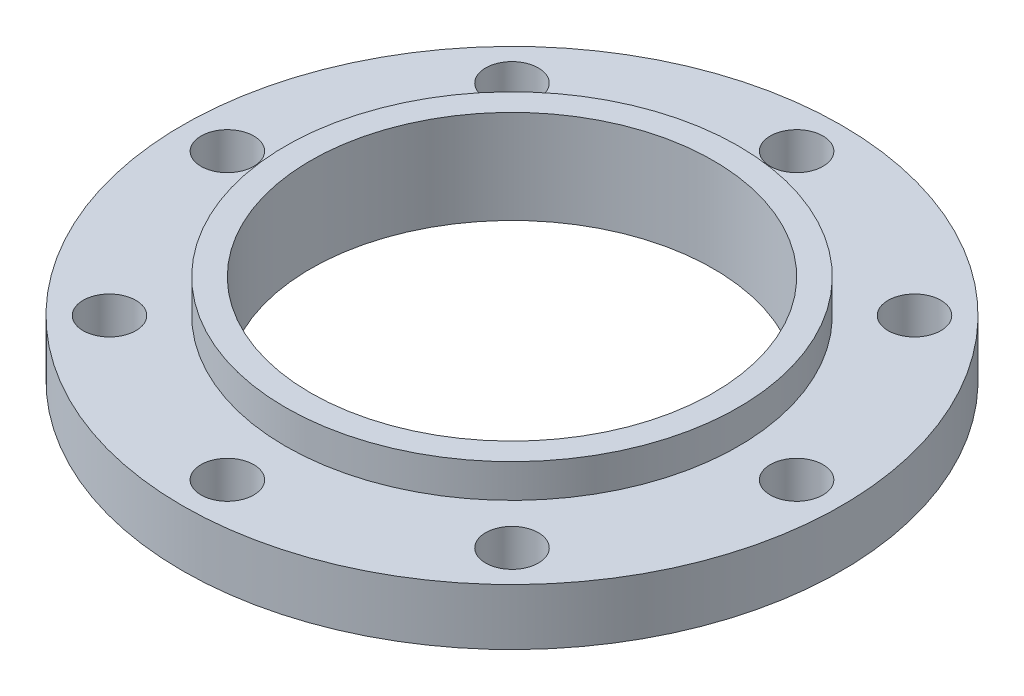
ISO-10303-21;
HEADER;
FILE_DESCRIPTION(('STEP AP214'),'2;1');
FILE_NAME('part.step','',(''),(''),'','','');
FILE_SCHEMA(('AUTOMOTIVE_DESIGN { 1 0 10303 214 1 1 1 1 }'));
ENDSEC;
DATA;
#1=APPLICATION_CONTEXT('core data for automotive mechanical design processes');
#2=APPLICATION_PROTOCOL_DEFINITION('international standard','automotive_design',2000,#1);
#3=PRODUCT_CONTEXT('',#1,'mechanical');
#4=PRODUCT('Part','Part','',(#3));
#5=PRODUCT_RELATED_PRODUCT_CATEGORY('part','',(#4));
#6=PRODUCT_DEFINITION_FORMATION('','',#4);
#7=PRODUCT_DEFINITION_CONTEXT('part definition',#1,'design');
#8=PRODUCT_DEFINITION('design','',#6,#7);
#9=PRODUCT_DEFINITION_SHAPE('','',#8);
#10=(LENGTH_UNIT() NAMED_UNIT(*) SI_UNIT(.MILLI.,.METRE.));
#11=(NAMED_UNIT(*) PLANE_ANGLE_UNIT() SI_UNIT($,.RADIAN.));
#12=(NAMED_UNIT(*) SI_UNIT($,.STERADIAN.) SOLID_ANGLE_UNIT());
#13=UNCERTAINTY_MEASURE_WITH_UNIT(LENGTH_MEASURE(1.E-05),#10,'distance_accuracy_value','');
#14=(GEOMETRIC_REPRESENTATION_CONTEXT(3) GLOBAL_UNCERTAINTY_ASSIGNED_CONTEXT((#13)) GLOBAL_UNIT_ASSIGNED_CONTEXT((#10,
#11,#12)) REPRESENTATION_CONTEXT('',''));
#15=CARTESIAN_POINT('',(0.,0.,0.));
#16=DIRECTION('',(0.,0.,1.));
#17=DIRECTION('',(1.,0.,0.));
#18=AXIS2_PLACEMENT_3D('',#15,#16,#17);
#19=CARTESIAN_POINT('',(0.,11.0243998816066,0.));
#20=DIRECTION('',(0.,-1.,0.));
#21=DIRECTION('',(0.,0.,-1.));
#22=AXIS2_PLACEMENT_3D('',#19,#20,#21);
#23=CYLINDRICAL_SURFACE('',#22,139.7);
#24=CARTESIAN_POINT('',(0.,11.0243998816066,0.));
#25=DIRECTION('',(0.,1.,0.));
#26=DIRECTION('',(0.,0.,1.));
#27=AXIS2_PLACEMENT_3D('',#24,#25,#26);
#28=CIRCLE('',#27,139.7);
#29=CARTESIAN_POINT('',(0.,11.0243998816066,139.7));
#30=VERTEX_POINT('',#29);
#31=EDGE_CURVE('E10',#30,#30,#28,.T.);
#32=ORIENTED_EDGE('',*,*,#31,.F.);
#33=EDGE_LOOP('',(#32));
#34=FACE_BOUND('',#33,.T.);
#35=CARTESIAN_POINT('',(0.,-12.8516001183934,0.));
#36=DIRECTION('',(0.,1.,0.));
#37=DIRECTION('',(0.,0.,1.));
#38=AXIS2_PLACEMENT_3D('',#35,#36,#37);
#39=CIRCLE('',#38,139.7);
#40=CARTESIAN_POINT('',(0.,-12.8516001183934,139.7));
#41=VERTEX_POINT('',#40);
#42=EDGE_CURVE('E42',#41,#41,#39,.T.);
#43=ORIENTED_EDGE('',*,*,#42,.T.);
#44=EDGE_LOOP('',(#43));
#45=FACE_BOUND('',#44,.T.);
#46=ADVANCED_FACE('F35',(#34,#45),#23,.T.);
#47=CARTESIAN_POINT('',(0.,11.0243998816066,0.));
#48=DIRECTION('',(0.,1.,0.));
#49=DIRECTION('',(0.,0.,1.));
#50=AXIS2_PLACEMENT_3D('',#47,#48,#49);
#51=PLANE('',#50);
#52=CARTESIAN_POINT('',(120.65,11.0243998816066,4.13197675184511E-13));
#53=DIRECTION('',(0.,1.,0.));
#54=DIRECTION('',(0.,0.,1.));
#55=AXIS2_PLACEMENT_3D('',#52,#53,#54);
#56=CIRCLE('',#55,11.176);
#57=CARTESIAN_POINT('',(120.65,11.0243998816066,11.1760000000004));
#58=VERTEX_POINT('',#57);
#59=EDGE_CURVE('E69',#58,#58,#56,.F.);
#60=ORIENTED_EDGE('',*,*,#59,.T.);
#61=EDGE_LOOP('',(#60));
#62=FACE_BOUND('',#61,.T.);
#63=CARTESIAN_POINT('',(85.3124331501565,11.0243998816066,85.3124331501574));
#64=DIRECTION('',(0.,1.,0.));
#65=DIRECTION('',(0.,0.,1.));
#66=AXIS2_PLACEMENT_3D('',#63,#64,#65);
#67=CIRCLE('',#66,11.176);
#68=CARTESIAN_POINT('',(85.3124331501565,11.0243998816066,96.4884331501574));
#69=VERTEX_POINT('',#68);
#70=EDGE_CURVE('E72',#69,#69,#67,.F.);
#71=ORIENTED_EDGE('',*,*,#70,.T.);
#72=EDGE_LOOP('',(#71));
#73=FACE_BOUND('',#72,.T.);
#74=CARTESIAN_POINT('',(0.,11.0243998816066,120.65));
#75=DIRECTION('',(0.,1.,0.));
#76=DIRECTION('',(0.,0.,1.));
#77=AXIS2_PLACEMENT_3D('',#74,#75,#76);
#78=CIRCLE('',#77,11.176);
#79=CARTESIAN_POINT('',(0.,11.0243998816066,131.826));
#80=VERTEX_POINT('',#79);
#81=EDGE_CURVE('E75',#80,#80,#78,.F.);
#82=ORIENTED_EDGE('',*,*,#81,.T.);
#83=EDGE_LOOP('',(#82));
#84=FACE_BOUND('',#83,.T.);
#85=CARTESIAN_POINT('',(-85.3124331501577,11.0243998816066,85.3124331501562));
#86=DIRECTION('',(0.,1.,0.));
#87=DIRECTION('',(0.,0.,1.));
#88=AXIS2_PLACEMENT_3D('',#85,#86,#87);
#89=CIRCLE('',#88,11.176);
#90=CARTESIAN_POINT('',(-85.3124331501577,11.0243998816066,96.4884331501562));
#91=VERTEX_POINT('',#90);
#92=EDGE_CURVE('E78',#91,#91,#89,.F.);
#93=ORIENTED_EDGE('',*,*,#92,.T.);
#94=EDGE_LOOP('',(#93));
#95=FACE_BOUND('',#94,.T.);
#96=CARTESIAN_POINT('',(-120.65,11.0243998816066,-1.27179121894119E-12));
#97=DIRECTION('',(0.,1.,0.));
#98=DIRECTION('',(0.,0.,1.));
#99=AXIS2_PLACEMENT_3D('',#96,#97,#98);
#100=CIRCLE('',#99,11.176);
#101=CARTESIAN_POINT('',(-120.65,11.0243998816066,11.1759999999987));
#102=VERTEX_POINT('',#101);
#103=EDGE_CURVE('E81',#102,#102,#100,.F.);
#104=ORIENTED_EDGE('',*,*,#103,.T.);
#105=EDGE_LOOP('',(#104));
#106=FACE_BOUND('',#105,.T.);
#107=CARTESIAN_POINT('',(-85.3124331501559,11.0243998816066,-85.312433150158));
#108=DIRECTION('',(0.,1.,0.));
#109=DIRECTION('',(0.,0.,1.));
#110=AXIS2_PLACEMENT_3D('',#107,#108,#109);
#111=CIRCLE('',#110,11.176);
#112=CARTESIAN_POINT('',(-85.3124331501559,11.0243998816066,-74.136433150158));
#113=VERTEX_POINT('',#112);
#114=EDGE_CURVE('E84',#113,#113,#111,.F.);
#115=ORIENTED_EDGE('',*,*,#114,.T.);
#116=EDGE_LOOP('',(#115));
#117=FACE_BOUND('',#116,.T.);
#118=CARTESIAN_POINT('',(85.3124331501571,11.0243998816066,-85.3124331501568));
#119=DIRECTION('',(0.,1.,0.));
#120=DIRECTION('',(0.,0.,1.));
#121=AXIS2_PLACEMENT_3D('',#118,#119,#120);
#122=CIRCLE('',#121,11.176);
#123=CARTESIAN_POINT('',(85.3124331501571,11.0243998816066,-74.1364331501568));
#124=VERTEX_POINT('',#123);
#125=EDGE_CURVE('E87',#124,#124,#122,.F.);
#126=ORIENTED_EDGE('',*,*,#125,.T.);
#127=EDGE_LOOP('',(#126));
#128=FACE_BOUND('',#127,.T.);
#129=CARTESIAN_POINT('',(0.,11.0243998816066,-120.65));
#130=DIRECTION('',(0.,1.,0.));
#131=DIRECTION('',(0.,0.,1.));
#132=AXIS2_PLACEMENT_3D('',#129,#130,#131);
#133=CIRCLE('',#132,11.176);
#134=CARTESIAN_POINT('',(0.,11.0243998816066,-109.474));
#135=VERTEX_POINT('',#134);
#136=EDGE_CURVE('E63',#135,#135,#133,.F.);
#137=ORIENTED_EDGE('',*,*,#136,.T.);
#138=EDGE_LOOP('',(#137));
#139=FACE_BOUND('',#138,.T.);
#140=CARTESIAN_POINT('',(0.,11.0243998816066,0.));
#141=DIRECTION('',(0.,1.,0.));
#142=DIRECTION('',(0.,0.,1.));
#143=AXIS2_PLACEMENT_3D('',#140,#141,#142);
#144=CIRCLE('',#143,96.012);
#145=CARTESIAN_POINT('',(0.,11.0243998816066,96.012));
#146=VERTEX_POINT('',#145);
#147=EDGE_CURVE('E47',#146,#146,#144,.F.);
#148=ORIENTED_EDGE('',*,*,#147,.T.);
#149=EDGE_LOOP('',(#148));
#150=FACE_BOUND('',#149,.T.);
#151=ORIENTED_EDGE('',*,*,#31,.T.);
#152=EDGE_LOOP('',(#151));
#153=FACE_BOUND('',#152,.T.);
#154=ADVANCED_FACE('F133',(#62,#73,#84,#95,#106,#117,#128,#139,#150,#153),#51,.T.);
#155=CARTESIAN_POINT('',(0.,-12.8516001183934,0.));
#156=DIRECTION('',(0.,1.,0.));
#157=DIRECTION('',(0.,0.,1.));
#158=AXIS2_PLACEMENT_3D('',#155,#156,#157);
#159=PLANE('',#158);
#160=CARTESIAN_POINT('',(120.65,-12.8516001183934,4.13197675184511E-13));
#161=DIRECTION('',(0.,1.,0.));
#162=DIRECTION('',(-1.,0.,0.));
#163=AXIS2_PLACEMENT_3D('',#160,#161,#162);
#164=CIRCLE('',#163,11.176);
#165=CARTESIAN_POINT('',(109.474,-12.8516001183934,3.741768797416E-13));
#166=VERTEX_POINT('',#165);
#167=EDGE_CURVE('E93',#166,#166,#164,.T.);
#168=ORIENTED_EDGE('',*,*,#167,.T.);
#169=EDGE_LOOP('',(#168));
#170=FACE_BOUND('',#169,.T.);
#171=CARTESIAN_POINT('',(85.3124331501565,-12.8516001183934,85.3124331501574));
#172=DIRECTION('',(0.,1.,0.));
#173=DIRECTION('',(-0.707106781186544,0.,-0.707106781186551));
#174=AXIS2_PLACEMENT_3D('',#171,#172,#173);
#175=CIRCLE('',#174,11.176);
#176=CARTESIAN_POINT('',(77.4098077636157,-12.8516001183934,77.4098077636165));
#177=VERTEX_POINT('',#176);
#178=EDGE_CURVE('E101',#177,#177,#175,.T.);
#179=ORIENTED_EDGE('',*,*,#178,.T.);
#180=EDGE_LOOP('',(#179));
#181=FACE_BOUND('',#180,.T.);
#182=CARTESIAN_POINT('',(0.,-12.8516001183934,120.65));
#183=DIRECTION('',(0.,1.,0.));
#184=DIRECTION('',(0.,0.,-1.));
#185=AXIS2_PLACEMENT_3D('',#182,#183,#184);
#186=CIRCLE('',#185,11.176);
#187=CARTESIAN_POINT('',(0.,-12.8516001183934,109.474));
#188=VERTEX_POINT('',#187);
#189=EDGE_CURVE('E97',#188,#188,#186,.T.);
#190=ORIENTED_EDGE('',*,*,#189,.T.);
#191=EDGE_LOOP('',(#190));
#192=FACE_BOUND('',#191,.T.);
#193=CARTESIAN_POINT('',(-85.3124331501577,-12.8516001183934,85.3124331501562));
#194=DIRECTION('',(0.,1.,0.));
#195=DIRECTION('',(0.707106781186554,0.,-0.707106781186541));
#196=AXIS2_PLACEMENT_3D('',#193,#194,#195);
#197=CIRCLE('',#196,11.176);
#198=CARTESIAN_POINT('',(-77.4098077636168,-12.8516001183934,77.4098077636154));
#199=VERTEX_POINT('',#198);
#200=EDGE_CURVE('E94',#199,#199,#197,.T.);
#201=ORIENTED_EDGE('',*,*,#200,.T.);
#202=EDGE_LOOP('',(#201));
#203=FACE_BOUND('',#202,.T.);
#204=CARTESIAN_POINT('',(-120.65,-12.8516001183934,-1.27179121894119E-12));
#205=DIRECTION('',(0.,1.,0.));
#206=DIRECTION('',(1.,0.,0.));
#207=AXIS2_PLACEMENT_3D('',#204,#205,#206);
#208=CIRCLE('',#207,11.176);
#209=CARTESIAN_POINT('',(-109.474,-12.8516001183934,-1.15472883261245E-12));
#210=VERTEX_POINT('',#209);
#211=EDGE_CURVE('E98',#210,#210,#208,.T.);
#212=ORIENTED_EDGE('',*,*,#211,.T.);
#213=EDGE_LOOP('',(#212));
#214=FACE_BOUND('',#213,.T.);
#215=CARTESIAN_POINT('',(-85.3124331501559,-12.8516001183934,-85.312433150158));
#216=DIRECTION('',(0.,1.,0.));
#217=DIRECTION('',(0.707106781186539,0.,0.707106781186556));
#218=AXIS2_PLACEMENT_3D('',#215,#216,#217);
#219=CIRCLE('',#218,11.176);
#220=CARTESIAN_POINT('',(-77.4098077636151,-12.8516001183934,-77.409807763617));
#221=VERTEX_POINT('',#220);
#222=EDGE_CURVE('E106',#221,#221,#219,.T.);
#223=ORIENTED_EDGE('',*,*,#222,.T.);
#224=EDGE_LOOP('',(#223));
#225=FACE_BOUND('',#224,.T.);
#226=CARTESIAN_POINT('',(85.3124331501571,-12.8516001183934,-85.3124331501568));
#227=DIRECTION('',(0.,1.,0.));
#228=DIRECTION('',(-0.707106781186549,0.,0.707106781186546));
#229=AXIS2_PLACEMENT_3D('',#226,#227,#228);
#230=CIRCLE('',#229,11.176);
#231=CARTESIAN_POINT('',(77.4098077636162,-12.8516001183934,-77.409807763616));
#232=VERTEX_POINT('',#231);
#233=EDGE_CURVE('E90',#232,#232,#230,.T.);
#234=ORIENTED_EDGE('',*,*,#233,.T.);
#235=EDGE_LOOP('',(#234));
#236=FACE_BOUND('',#235,.T.);
#237=CARTESIAN_POINT('',(0.,-12.8516001183934,-120.65));
#238=DIRECTION('',(0.,1.,0.));
#239=DIRECTION('',(0.,0.,1.));
#240=AXIS2_PLACEMENT_3D('',#237,#238,#239);
#241=CIRCLE('',#240,11.176);
#242=CARTESIAN_POINT('',(0.,-12.8516001183934,-109.474));
#243=VERTEX_POINT('',#242);
#244=EDGE_CURVE('E66',#243,#243,#241,.T.);
#245=ORIENTED_EDGE('',*,*,#244,.T.);
#246=EDGE_LOOP('',(#245));
#247=FACE_BOUND('',#246,.T.);
#248=CARTESIAN_POINT('',(0.,-12.8516001183934,0.));
#249=DIRECTION('',(0.,1.,0.));
#250=DIRECTION('',(0.,0.,1.));
#251=AXIS2_PLACEMENT_3D('',#248,#249,#250);
#252=CIRCLE('',#251,107.95);
#253=CARTESIAN_POINT('',(0.,-12.8516001183934,107.95));
#254=VERTEX_POINT('',#253);
#255=EDGE_CURVE('E55',#254,#254,#252,.T.);
#256=ORIENTED_EDGE('',*,*,#255,.T.);
#257=EDGE_LOOP('',(#256));
#258=FACE_BOUND('',#257,.T.);
#259=ORIENTED_EDGE('',*,*,#42,.F.);
#260=EDGE_LOOP('',(#259));
#261=FACE_BOUND('',#260,.T.);
#262=ADVANCED_FACE('F112',(#170,#181,#192,#203,#214,#225,#236,#247,#258,#261),#159,.F.);
#263=CARTESIAN_POINT('',(0.,25.2483998816066,0.));
#264=DIRECTION('',(0.,-1.,0.));
#265=DIRECTION('',(0.,0.,-1.));
#266=AXIS2_PLACEMENT_3D('',#263,#264,#265);
#267=CYLINDRICAL_SURFACE('',#266,96.012);
#268=ORIENTED_EDGE('',*,*,#147,.F.);
#269=EDGE_LOOP('',(#268));
#270=FACE_BOUND('',#269,.T.);
#271=CARTESIAN_POINT('',(0.,25.2483998816066,0.));
#272=DIRECTION('',(0.,1.,0.));
#273=DIRECTION('',(0.,0.,1.));
#274=AXIS2_PLACEMENT_3D('',#271,#272,#273);
#275=CIRCLE('',#274,96.012);
#276=CARTESIAN_POINT('',(0.,25.2483998816066,96.012));
#277=VERTEX_POINT('',#276);
#278=EDGE_CURVE('E51',#277,#277,#275,.T.);
#279=ORIENTED_EDGE('',*,*,#278,.F.);
#280=EDGE_LOOP('',(#279));
#281=FACE_BOUND('',#280,.T.);
#282=ADVANCED_FACE('F144',(#270,#281),#267,.T.);
#283=CARTESIAN_POINT('',(0.,25.2483998816066,0.));
#284=DIRECTION('',(0.,1.,0.));
#285=DIRECTION('',(0.,0.,1.));
#286=AXIS2_PLACEMENT_3D('',#283,#284,#285);
#287=PLANE('',#286);
#288=CARTESIAN_POINT('',(0.,25.2483998816067,0.));
#289=DIRECTION('',(0.,1.,0.));
#290=DIRECTION('',(0.,0.,1.));
#291=AXIS2_PLACEMENT_3D('',#288,#289,#290);
#292=CIRCLE('',#291,85.344);
#293=CARTESIAN_POINT('',(0.,25.2483998816067,85.344));
#294=VERTEX_POINT('',#293);
#295=EDGE_CURVE('E58',#294,#294,#292,.F.);
#296=ORIENTED_EDGE('',*,*,#295,.T.);
#297=EDGE_LOOP('',(#296));
#298=FACE_BOUND('',#297,.T.);
#299=ORIENTED_EDGE('',*,*,#278,.T.);
#300=EDGE_LOOP('',(#299));
#301=FACE_BOUND('',#300,.T.);
#302=ADVANCED_FACE('F149',(#298,#301),#287,.T.);
#303=CARTESIAN_POINT('',(0.,-14.4391001183934,0.));
#304=DIRECTION('',(0.,1.,0.));
#305=DIRECTION('',(0.,0.,1.));
#306=AXIS2_PLACEMENT_3D('',#303,#304,#305);
#307=CYLINDRICAL_SURFACE('',#306,107.95);
#308=CARTESIAN_POINT('',(0.,-14.4391001183934,0.));
#309=DIRECTION('',(0.,1.,0.));
#310=DIRECTION('',(0.,0.,1.));
#311=AXIS2_PLACEMENT_3D('',#308,#309,#310);
#312=CIRCLE('',#311,107.95);
#313=CARTESIAN_POINT('',(0.,-14.4391001183934,107.95));
#314=VERTEX_POINT('',#313);
#315=EDGE_CURVE('E54',#314,#314,#312,.T.);
#316=ORIENTED_EDGE('',*,*,#315,.T.);
#317=EDGE_LOOP('',(#316));
#318=FACE_BOUND('',#317,.T.);
#319=ORIENTED_EDGE('',*,*,#255,.F.);
#320=EDGE_LOOP('',(#319));
#321=FACE_BOUND('',#320,.T.);
#322=ADVANCED_FACE('F156',(#318,#321),#307,.T.);
#323=CARTESIAN_POINT('',(0.,-14.4391001183934,0.));
#324=DIRECTION('',(0.,1.,0.));
#325=DIRECTION('',(0.,0.,1.));
#326=AXIS2_PLACEMENT_3D('',#323,#324,#325);
#327=PLANE('',#326);
#328=CARTESIAN_POINT('',(0.,-14.4391001183934,0.));
#329=DIRECTION('',(0.,1.,0.));
#330=DIRECTION('',(0.,0.,1.));
#331=AXIS2_PLACEMENT_3D('',#328,#329,#330);
#332=CIRCLE('',#331,85.344);
#333=CARTESIAN_POINT('',(0.,-14.4391001183934,85.344));
#334=VERTEX_POINT('',#333);
#335=EDGE_CURVE('E38',#334,#334,#332,.F.);
#336=ORIENTED_EDGE('',*,*,#335,.F.);
#337=EDGE_LOOP('',(#336));
#338=FACE_BOUND('',#337,.T.);
#339=ORIENTED_EDGE('',*,*,#315,.F.);
#340=EDGE_LOOP('',(#339));
#341=FACE_BOUND('',#340,.T.);
#342=ADVANCED_FACE('F160',(#338,#341),#327,.F.);
#343=CARTESIAN_POINT('',(0.,495.148399881607,0.));
#344=DIRECTION('',(0.,-1.,0.));
#345=DIRECTION('',(0.,0.,-1.));
#346=AXIS2_PLACEMENT_3D('',#343,#344,#345);
#347=CYLINDRICAL_SURFACE('',#346,85.344);
#348=ORIENTED_EDGE('',*,*,#295,.F.);
#349=EDGE_LOOP('',(#348));
#350=FACE_BOUND('',#349,.T.);
#351=ORIENTED_EDGE('',*,*,#335,.T.);
#352=EDGE_LOOP('',(#351));
#353=FACE_BOUND('',#352,.T.);
#354=ADVANCED_FACE('F164',(#350,#353),#347,.F.);
#355=CARTESIAN_POINT('',(0.,166.535899881607,-120.65));
#356=DIRECTION('',(0.,-1.,0.));
#357=DIRECTION('',(0.,0.,-1.));
#358=AXIS2_PLACEMENT_3D('',#355,#356,#357);
#359=CYLINDRICAL_SURFACE('',#358,11.176);
#360=ORIENTED_EDGE('',*,*,#136,.F.);
#361=EDGE_LOOP('',(#360));
#362=FACE_BOUND('',#361,.T.);
#363=ORIENTED_EDGE('',*,*,#244,.F.);
#364=EDGE_LOOP('',(#363));
#365=FACE_BOUND('',#364,.T.);
#366=ADVANCED_FACE('F168',(#362,#365),#359,.F.);
#367=CARTESIAN_POINT('',(85.3124331501571,166.535899881607,-85.3124331501568));
#368=DIRECTION('',(0.,-1.,0.));
#369=DIRECTION('',(0.,0.,-1.));
#370=AXIS2_PLACEMENT_3D('',#367,#368,#369);
#371=CYLINDRICAL_SURFACE('',#370,11.176);
#372=ORIENTED_EDGE('',*,*,#125,.F.);
#373=EDGE_LOOP('',(#372));
#374=FACE_BOUND('',#373,.T.);
#375=ORIENTED_EDGE('',*,*,#233,.F.);
#376=EDGE_LOOP('',(#375));
#377=FACE_BOUND('',#376,.T.);
#378=ADVANCED_FACE('F128',(#374,#377),#371,.F.);
#379=CARTESIAN_POINT('',(-85.3124331501559,166.535899881607,-85.312433150158));
#380=DIRECTION('',(0.,-1.,0.));
#381=DIRECTION('',(0.,0.,-1.));
#382=AXIS2_PLACEMENT_3D('',#379,#380,#381);
#383=CYLINDRICAL_SURFACE('',#382,11.176);
#384=ORIENTED_EDGE('',*,*,#114,.F.);
#385=EDGE_LOOP('',(#384));
#386=FACE_BOUND('',#385,.T.);
#387=ORIENTED_EDGE('',*,*,#222,.F.);
#388=EDGE_LOOP('',(#387));
#389=FACE_BOUND('',#388,.T.);
#390=ADVANCED_FACE('F118',(#386,#389),#383,.F.);
#391=CARTESIAN_POINT('',(-120.65,166.535899881607,-1.27179121894119E-12));
#392=DIRECTION('',(0.,-1.,0.));
#393=DIRECTION('',(0.,0.,-1.));
#394=AXIS2_PLACEMENT_3D('',#391,#392,#393);
#395=CYLINDRICAL_SURFACE('',#394,11.176);
#396=ORIENTED_EDGE('',*,*,#103,.F.);
#397=EDGE_LOOP('',(#396));
#398=FACE_BOUND('',#397,.T.);
#399=ORIENTED_EDGE('',*,*,#211,.F.);
#400=EDGE_LOOP('',(#399));
#401=FACE_BOUND('',#400,.T.);
#402=ADVANCED_FACE('F115',(#398,#401),#395,.F.);
#403=CARTESIAN_POINT('',(-85.3124331501577,166.535899881607,85.3124331501562));
#404=DIRECTION('',(0.,-1.,0.));
#405=DIRECTION('',(0.,0.,-1.));
#406=AXIS2_PLACEMENT_3D('',#403,#404,#405);
#407=CYLINDRICAL_SURFACE('',#406,11.176);
#408=ORIENTED_EDGE('',*,*,#92,.F.);
#409=EDGE_LOOP('',(#408));
#410=FACE_BOUND('',#409,.T.);
#411=ORIENTED_EDGE('',*,*,#200,.F.);
#412=EDGE_LOOP('',(#411));
#413=FACE_BOUND('',#412,.T.);
#414=ADVANCED_FACE('F117',(#410,#413),#407,.F.);
#415=CARTESIAN_POINT('',(0.,166.535899881607,120.65));
#416=DIRECTION('',(0.,-1.,0.));
#417=DIRECTION('',(0.,0.,-1.));
#418=AXIS2_PLACEMENT_3D('',#415,#416,#417);
#419=CYLINDRICAL_SURFACE('',#418,11.176);
#420=ORIENTED_EDGE('',*,*,#81,.F.);
#421=EDGE_LOOP('',(#420));
#422=FACE_BOUND('',#421,.T.);
#423=ORIENTED_EDGE('',*,*,#189,.F.);
#424=EDGE_LOOP('',(#423));
#425=FACE_BOUND('',#424,.T.);
#426=ADVANCED_FACE('F125',(#422,#425),#419,.F.);
#427=CARTESIAN_POINT('',(85.3124331501565,166.535899881607,85.3124331501574));
#428=DIRECTION('',(0.,-1.,0.));
#429=DIRECTION('',(0.,0.,-1.));
#430=AXIS2_PLACEMENT_3D('',#427,#428,#429);
#431=CYLINDRICAL_SURFACE('',#430,11.176);
#432=ORIENTED_EDGE('',*,*,#70,.F.);
#433=EDGE_LOOP('',(#432));
#434=FACE_BOUND('',#433,.T.);
#435=ORIENTED_EDGE('',*,*,#178,.F.);
#436=EDGE_LOOP('',(#435));
#437=FACE_BOUND('',#436,.T.);
#438=ADVANCED_FACE('F178',(#434,#437),#431,.F.);
#439=CARTESIAN_POINT('',(120.65,166.535899881607,4.13197675184511E-13));
#440=DIRECTION('',(0.,-1.,0.));
#441=DIRECTION('',(0.,0.,-1.));
#442=AXIS2_PLACEMENT_3D('',#439,#440,#441);
#443=CYLINDRICAL_SURFACE('',#442,11.176);
#444=ORIENTED_EDGE('',*,*,#59,.F.);
#445=EDGE_LOOP('',(#444));
#446=FACE_BOUND('',#445,.T.);
#447=ORIENTED_EDGE('',*,*,#167,.F.);
#448=EDGE_LOOP('',(#447));
#449=FACE_BOUND('',#448,.T.);
#450=ADVANCED_FACE('F182',(#446,#449),#443,.F.);
#451=CLOSED_SHELL('',(#46,#154,#262,#282,#302,#322,#342,#354,#366,#378,#390,#402,#414,#426,#438,#450));
#452=MANIFOLD_SOLID_BREP('B2',#451);
#453=ADVANCED_BREP_SHAPE_REPRESENTATION('',(#18,#452),#14);
#454=SHAPE_DEFINITION_REPRESENTATION(#9,#453);
ENDSEC;
END-ISO-10303-21;
